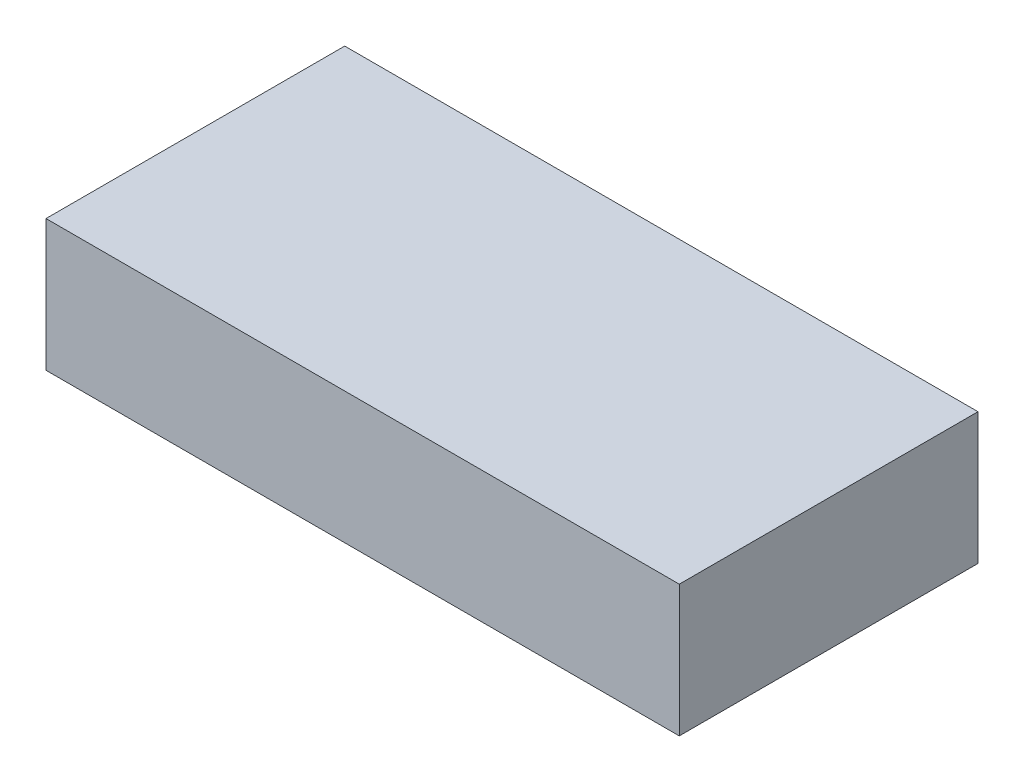
ISO-10303-21;
HEADER;
FILE_DESCRIPTION(('STEP AP214'),'2;1');
FILE_NAME('part.step','',(''),(''),'','','');
FILE_SCHEMA(('AUTOMOTIVE_DESIGN { 1 0 10303 214 1 1 1 1 }'));
ENDSEC;
DATA;
#1=APPLICATION_CONTEXT('core data for automotive mechanical design processes');
#2=APPLICATION_PROTOCOL_DEFINITION('international standard','automotive_design',2000,#1);
#3=PRODUCT_CONTEXT('',#1,'mechanical');
#4=PRODUCT('Part','Part','',(#3));
#5=PRODUCT_RELATED_PRODUCT_CATEGORY('part','',(#4));
#6=PRODUCT_DEFINITION_FORMATION('','',#4);
#7=PRODUCT_DEFINITION_CONTEXT('part definition',#1,'design');
#8=PRODUCT_DEFINITION('design','',#6,#7);
#9=PRODUCT_DEFINITION_SHAPE('','',#8);
#10=(LENGTH_UNIT() NAMED_UNIT(*) SI_UNIT(.MILLI.,.METRE.));
#11=(NAMED_UNIT(*) PLANE_ANGLE_UNIT() SI_UNIT($,.RADIAN.));
#12=(NAMED_UNIT(*) SI_UNIT($,.STERADIAN.) SOLID_ANGLE_UNIT());
#13=UNCERTAINTY_MEASURE_WITH_UNIT(LENGTH_MEASURE(1.E-05),#10,'distance_accuracy_value','');
#14=(GEOMETRIC_REPRESENTATION_CONTEXT(3) GLOBAL_UNCERTAINTY_ASSIGNED_CONTEXT((#13)) GLOBAL_UNIT_ASSIGNED_CONTEXT((#10,
#11,#12)) REPRESENTATION_CONTEXT('',''));
#15=CARTESIAN_POINT('',(0.,0.,0.));
#16=DIRECTION('',(0.,0.,1.));
#17=DIRECTION('',(1.,0.,0.));
#18=AXIS2_PLACEMENT_3D('',#15,#16,#17);
#19=CARTESIAN_POINT('',(0.,11.,0.));
#20=DIRECTION('',(1.,0.,0.));
#21=DIRECTION('',(0.,0.,-1.));
#22=AXIS2_PLACEMENT_3D('',#19,#20,#21);
#23=PLANE('',#22);
#24=DIRECTION('',(0.,0.,1.));
#25=VECTOR('',#24,1.);
#26=CARTESIAN_POINT('',(0.,0.,0.));
#27=LINE('',#26,#25);
#28=CARTESIAN_POINT('',(0.,0.,0.));
#29=VERTEX_POINT('',#28);
#30=CARTESIAN_POINT('',(0.,0.,25.));
#31=VERTEX_POINT('',#30);
#32=EDGE_CURVE('E99',#29,#31,#27,.T.);
#33=ORIENTED_EDGE('',*,*,#32,.T.);
#34=DIRECTION('',(0.,-1.,0.));
#35=VECTOR('',#34,1.);
#36=CARTESIAN_POINT('',(0.,11.,25.));
#37=LINE('',#36,#35);
#38=CARTESIAN_POINT('',(0.,11.,25.));
#39=VERTEX_POINT('',#38);
#40=EDGE_CURVE('E11',#39,#31,#37,.T.);
#41=ORIENTED_EDGE('',*,*,#40,.F.);
#42=DIRECTION('',(0.,0.,1.));
#43=VECTOR('',#42,1.);
#44=CARTESIAN_POINT('',(0.,11.,0.));
#45=LINE('',#44,#43);
#46=CARTESIAN_POINT('',(0.,11.,0.));
#47=VERTEX_POINT('',#46);
#48=EDGE_CURVE('E87',#47,#39,#45,.T.);
#49=ORIENTED_EDGE('',*,*,#48,.F.);
#50=DIRECTION('',(0.,-1.,0.));
#51=VECTOR('',#50,1.);
#52=CARTESIAN_POINT('',(0.,11.,0.));
#53=LINE('',#52,#51);
#54=EDGE_CURVE('E95',#47,#29,#53,.T.);
#55=ORIENTED_EDGE('',*,*,#54,.T.);
#56=EDGE_LOOP('',(#33,#41,#49,#55));
#57=FACE_BOUND('',#56,.T.);
#58=ADVANCED_FACE('F36',(#57),#23,.F.);
#59=CARTESIAN_POINT('',(0.,11.,25.));
#60=DIRECTION('',(0.,0.,-1.));
#61=DIRECTION('',(-1.,0.,0.));
#62=AXIS2_PLACEMENT_3D('',#59,#60,#61);
#63=PLANE('',#62);
#64=DIRECTION('',(1.,0.,0.));
#65=VECTOR('',#64,1.);
#66=CARTESIAN_POINT('',(0.,0.,25.));
#67=LINE('',#66,#65);
#68=CARTESIAN_POINT('',(53.,0.,25.));
#69=VERTEX_POINT('',#68);
#70=EDGE_CURVE('E91',#31,#69,#67,.T.);
#71=ORIENTED_EDGE('',*,*,#70,.T.);
#72=DIRECTION('',(0.,-1.,0.));
#73=VECTOR('',#72,1.);
#74=CARTESIAN_POINT('',(53.,11.,25.));
#75=LINE('',#74,#73);
#76=CARTESIAN_POINT('',(53.,11.,25.));
#77=VERTEX_POINT('',#76);
#78=EDGE_CURVE('E44',#77,#69,#75,.T.);
#79=ORIENTED_EDGE('',*,*,#78,.F.);
#80=DIRECTION('',(1.,0.,0.));
#81=VECTOR('',#80,1.);
#82=CARTESIAN_POINT('',(0.,11.,25.));
#83=LINE('',#82,#81);
#84=EDGE_CURVE('E82',#39,#77,#83,.T.);
#85=ORIENTED_EDGE('',*,*,#84,.F.);
#86=ORIENTED_EDGE('',*,*,#40,.T.);
#87=EDGE_LOOP('',(#71,#79,#85,#86));
#88=FACE_BOUND('',#87,.T.);
#89=ADVANCED_FACE('F90',(#88),#63,.F.);
#90=CARTESIAN_POINT('',(53.,11.,0.));
#91=DIRECTION('',(-1.,0.,0.));
#92=DIRECTION('',(0.,0.,1.));
#93=AXIS2_PLACEMENT_3D('',#90,#91,#92);
#94=PLANE('',#93);
#95=DIRECTION('',(0.,0.,-1.));
#96=VECTOR('',#95,1.);
#97=CARTESIAN_POINT('',(53.,0.,0.));
#98=LINE('',#97,#96);
#99=CARTESIAN_POINT('',(53.,0.,0.));
#100=VERTEX_POINT('',#99);
#101=EDGE_CURVE('E69',#69,#100,#98,.T.);
#102=ORIENTED_EDGE('',*,*,#101,.T.);
#103=DIRECTION('',(0.,-1.,0.));
#104=VECTOR('',#103,1.);
#105=CARTESIAN_POINT('',(53.,11.,0.));
#106=LINE('',#105,#104);
#107=CARTESIAN_POINT('',(53.,11.,0.));
#108=VERTEX_POINT('',#107);
#109=EDGE_CURVE('E92',#108,#100,#106,.T.);
#110=ORIENTED_EDGE('',*,*,#109,.F.);
#111=DIRECTION('',(0.,0.,-1.));
#112=VECTOR('',#111,1.);
#113=CARTESIAN_POINT('',(53.,11.,0.));
#114=LINE('',#113,#112);
#115=EDGE_CURVE('E85',#77,#108,#114,.T.);
#116=ORIENTED_EDGE('',*,*,#115,.F.);
#117=ORIENTED_EDGE('',*,*,#78,.T.);
#118=EDGE_LOOP('',(#102,#110,#116,#117));
#119=FACE_BOUND('',#118,.T.);
#120=ADVANCED_FACE('F93',(#119),#94,.F.);
#121=CARTESIAN_POINT('',(0.,11.,0.));
#122=DIRECTION('',(0.,0.,1.));
#123=DIRECTION('',(1.,0.,0.));
#124=AXIS2_PLACEMENT_3D('',#121,#122,#123);
#125=PLANE('',#124);
#126=DIRECTION('',(-1.,0.,0.));
#127=VECTOR('',#126,1.);
#128=CARTESIAN_POINT('',(0.,0.,0.));
#129=LINE('',#128,#127);
#130=EDGE_CURVE('E75',#100,#29,#129,.T.);
#131=ORIENTED_EDGE('',*,*,#130,.T.);
#132=ORIENTED_EDGE('',*,*,#54,.F.);
#133=DIRECTION('',(-1.,0.,0.));
#134=VECTOR('',#133,1.);
#135=CARTESIAN_POINT('',(0.,11.,0.));
#136=LINE('',#135,#134);
#137=EDGE_CURVE('E52',#108,#47,#136,.T.);
#138=ORIENTED_EDGE('',*,*,#137,.F.);
#139=ORIENTED_EDGE('',*,*,#109,.T.);
#140=EDGE_LOOP('',(#131,#132,#138,#139));
#141=FACE_BOUND('',#140,.T.);
#142=ADVANCED_FACE('F106',(#141),#125,.F.);
#143=CARTESIAN_POINT('',(0.,11.,0.));
#144=DIRECTION('',(0.,1.,0.));
#145=DIRECTION('',(0.,0.,1.));
#146=AXIS2_PLACEMENT_3D('',#143,#144,#145);
#147=PLANE('',#146);
#148=ORIENTED_EDGE('',*,*,#48,.T.);
#149=ORIENTED_EDGE('',*,*,#84,.T.);
#150=ORIENTED_EDGE('',*,*,#115,.T.);
#151=ORIENTED_EDGE('',*,*,#137,.T.);
#152=EDGE_LOOP('',(#148,#149,#150,#151));
#153=FACE_BOUND('',#152,.T.);
#154=ADVANCED_FACE('F83',(#153),#147,.T.);
#155=CARTESIAN_POINT('',(0.,0.,0.));
#156=DIRECTION('',(0.,1.,0.));
#157=DIRECTION('',(0.,0.,1.));
#158=AXIS2_PLACEMENT_3D('',#155,#156,#157);
#159=PLANE('',#158);
#160=ORIENTED_EDGE('',*,*,#32,.F.);
#161=ORIENTED_EDGE('',*,*,#130,.F.);
#162=ORIENTED_EDGE('',*,*,#101,.F.);
#163=ORIENTED_EDGE('',*,*,#70,.F.);
#164=EDGE_LOOP('',(#160,#161,#162,#163));
#165=FACE_BOUND('',#164,.T.);
#166=ADVANCED_FACE('F109',(#165),#159,.F.);
#167=CLOSED_SHELL('',(#58,#89,#120,#142,#154,#166));
#168=MANIFOLD_SOLID_BREP('B2',#167);
#169=ADVANCED_BREP_SHAPE_REPRESENTATION('',(#18,#168),#14);
#170=SHAPE_DEFINITION_REPRESENTATION(#9,#169);
ENDSEC;
END-ISO-10303-21;
